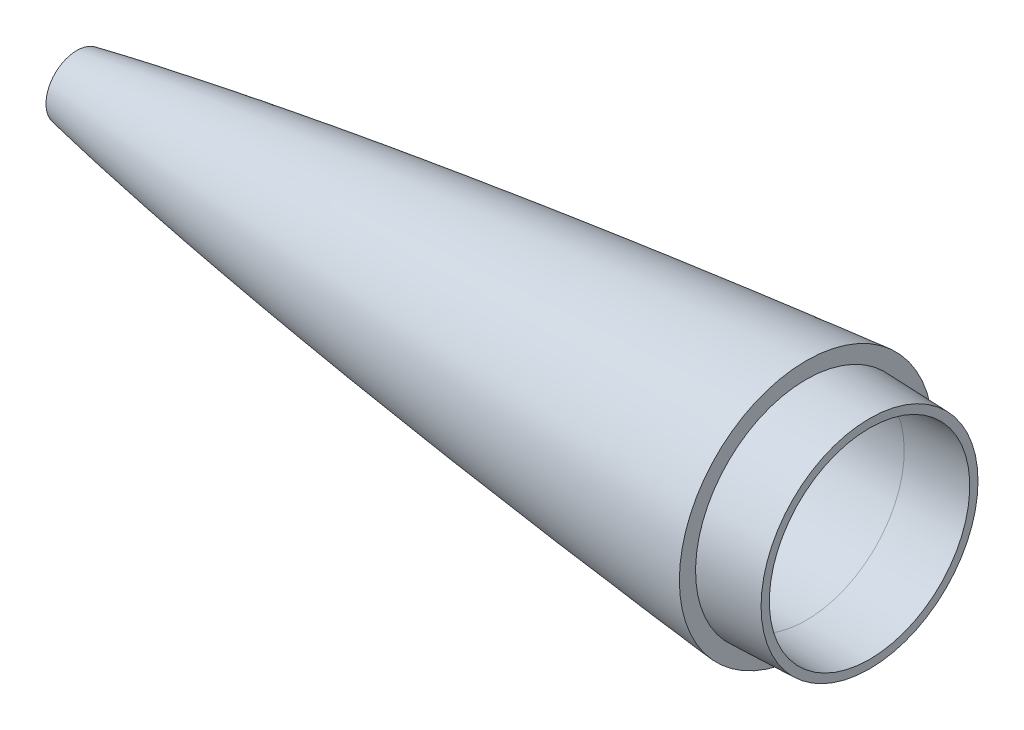
ISO-10303-21;
HEADER;
FILE_DESCRIPTION(('STEP AP214'),'2;1');
FILE_NAME('part.step','',(''),(''),'','','');
FILE_SCHEMA(('AUTOMOTIVE_DESIGN { 1 0 10303 214 1 1 1 1 }'));
ENDSEC;
DATA;
#1=APPLICATION_CONTEXT('core data for automotive mechanical design processes');
#2=APPLICATION_PROTOCOL_DEFINITION('international standard','automotive_design',2000,#1);
#3=PRODUCT_CONTEXT('',#1,'mechanical');
#4=PRODUCT('Part','Part','',(#3));
#5=PRODUCT_RELATED_PRODUCT_CATEGORY('part','',(#4));
#6=PRODUCT_DEFINITION_FORMATION('','',#4);
#7=PRODUCT_DEFINITION_CONTEXT('part definition',#1,'design');
#8=PRODUCT_DEFINITION('design','',#6,#7);
#9=PRODUCT_DEFINITION_SHAPE('','',#8);
#10=(LENGTH_UNIT() NAMED_UNIT(*) SI_UNIT(.MILLI.,.METRE.));
#11=(NAMED_UNIT(*) PLANE_ANGLE_UNIT() SI_UNIT($,.RADIAN.));
#12=(NAMED_UNIT(*) SI_UNIT($,.STERADIAN.) SOLID_ANGLE_UNIT());
#13=UNCERTAINTY_MEASURE_WITH_UNIT(LENGTH_MEASURE(1.E-05),#10,'distance_accuracy_value','');
#14=(GEOMETRIC_REPRESENTATION_CONTEXT(3) GLOBAL_UNCERTAINTY_ASSIGNED_CONTEXT((#13)) GLOBAL_UNIT_ASSIGNED_CONTEXT((#10,
#11,#12)) REPRESENTATION_CONTEXT('',''));
#15=CARTESIAN_POINT('',(0.,0.,0.));
#16=DIRECTION('',(0.,0.,1.));
#17=DIRECTION('',(1.,0.,0.));
#18=AXIS2_PLACEMENT_3D('',#15,#16,#17);
#19=CARTESIAN_POINT('',(-9.99999999999995,0.,0.));
#20=DIRECTION('',(1.,0.,0.));
#21=DIRECTION('',(0.,1.,0.));
#22=AXIS2_PLACEMENT_3D('',#19,#20,#21);
#23=DEGENERATE_TOROIDAL_SURFACE('',#22,2022.91313501116,2058.86901786388,.F.);
#24=CARTESIAN_POINT('',(-238.660865760801,0.,0.));
#25=DIRECTION('',(1.,0.,0.));
#26=DIRECTION('',(0.,1.,0.));
#27=AXIS2_PLACEMENT_3D('',#24,#25,#26);
#28=CIRCLE('',#27,23.2187867351589);
#29=CARTESIAN_POINT('',(-238.660865760801,23.2187867351589,0.));
#30=VERTEX_POINT('',#29);
#31=EDGE_CURVE('E64',#30,#30,#28,.F.);
#32=ORIENTED_EDGE('',*,*,#31,.F.);
#33=EDGE_LOOP('',(#32));
#34=FACE_BOUND('',#33,.T.);
#35=CARTESIAN_POINT('',(-372.8,0.,0.));
#36=DIRECTION('',(-1.,0.,0.));
#37=DIRECTION('',(0.,-1.,0.));
#38=AXIS2_PLACEMENT_3D('',#35,#36,#37);
#39=CIRCLE('',#38,3.73873265624036);
#40=CARTESIAN_POINT('',(-372.8,-3.73873265624037,0.));
#41=VERTEX_POINT('',#40);
#42=EDGE_CURVE('E51',#41,#41,#39,.T.);
#43=ORIENTED_EDGE('',*,*,#42,.T.);
#44=EDGE_LOOP('',(#43));
#45=FACE_BOUND('',#44,.T.);
#46=ADVANCED_FACE('F46',(#34,#45),#23,.T.);
#47=CARTESIAN_POINT('',(-210.,0.,0.));
#48=DIRECTION('',(1.,0.,0.));
#49=DIRECTION('',(0.,1.,0.));
#50=AXIS2_PLACEMENT_3D('',#47,#48,#49);
#51=PLANE('',#50);
#52=CARTESIAN_POINT('',(-210.,0.,0.));
#53=DIRECTION('',(1.,0.,0.));
#54=DIRECTION('',(0.,1.,0.));
#55=AXIS2_PLACEMENT_3D('',#52,#53,#54);
#56=CIRCLE('',#55,26.2187867351589);
#57=CARTESIAN_POINT('',(-210.,26.2187867351589,0.));
#58=VERTEX_POINT('',#57);
#59=EDGE_CURVE('E56',#58,#58,#56,.T.);
#60=ORIENTED_EDGE('',*,*,#59,.F.);
#61=EDGE_LOOP('',(#60));
#62=FACE_BOUND('',#61,.T.);
#63=CARTESIAN_POINT('',(-210.,0.,0.));
#64=DIRECTION('',(1.,0.,0.));
#65=DIRECTION('',(0.,1.,0.));
#66=AXIS2_PLACEMENT_3D('',#63,#64,#65);
#67=CIRCLE('',#66,30.0520321283327);
#68=CARTESIAN_POINT('',(-210.,30.0520321283327,0.));
#69=VERTEX_POINT('',#68);
#70=EDGE_CURVE('E11',#69,#69,#67,.T.);
#71=ORIENTED_EDGE('',*,*,#70,.T.);
#72=EDGE_LOOP('',(#71));
#73=FACE_BOUND('',#72,.T.);
#74=ADVANCED_FACE('F111',(#62,#73),#51,.T.);
#75=CARTESIAN_POINT('',(-410.,0.,0.));
#76=CARTESIAN_POINT('',(-409.996104343043,0.00976449689902335,0.));
#77=CARTESIAN_POINT('',(-409.985913153418,0.0279490747308062,0.));
#78=CARTESIAN_POINT('',(-409.957510571321,0.0594143028533337,0.));
#79=CARTESIAN_POINT('',(-409.898233487542,0.1142062146289,0.));
#80=CARTESIAN_POINT('',(-409.810537783304,0.17997009781727,0.));
#81=CARTESIAN_POINT('',(-409.676312366164,0.268169047261745,0.));
#82=CARTESIAN_POINT('',(-409.483787304396,0.379593537014922,0.));
#83=CARTESIAN_POINT('',(-409.212469031522,0.520885741333323,0.));
#84=CARTESIAN_POINT('',(-408.782228647582,0.722476645427516,0.));
#85=CARTESIAN_POINT('',(-408.0633328169,1.0244307263994,0.));
#86=CARTESIAN_POINT('',(-406.779619929941,1.50191951752579,0.));
#87=CARTESIAN_POINT('',(-404.418121727855,2.27068301003079,0.));
#88=CARTESIAN_POINT('',(-399.978466323839,3.52052425605253,0.));
#89=CARTESIAN_POINT('',(-392.218905514589,5.39313292092806,0.));
#90=CARTESIAN_POINT('',(-378.99508553227,8.1370308474546,0.));
#91=CARTESIAN_POINT('',(-360.816525388513,11.3764095789632,0.));
#92=CARTESIAN_POINT('',(-338.763877653047,14.8393803736611,0.));
#93=CARTESIAN_POINT('',(-314.22344301603,18.2908227784008,0.));
#94=CARTESIAN_POINT('',(-289.643356302951,21.4445876627348,0.));
#95=CARTESIAN_POINT('',(-265.032848706303,24.3508964604943,0.));
#96=CARTESIAN_POINT('',(-240.397990380166,27.0419167523867,0.));
#97=CARTESIAN_POINT('',(-215.742482431709,29.5365124328329,0.));
#98=CARTESIAN_POINT('',(-191.069036766365,31.8465331230353,0.));
#99=CARTESIAN_POINT('',(-166.37945951932,33.977380219421,0.));
#100=CARTESIAN_POINT('',(-141.675128405846,35.9296378563137,0.));
#101=CARTESIAN_POINT('',(-120.046737987028,37.4772955508728,0.));
#102=CARTESIAN_POINT('',(-101.499875990423,38.6821930104554,0.));
#103=CARTESIAN_POINT('',(-86.0387820796336,39.5986846871677,0.));
#104=CARTESIAN_POINT('',(-73.6667078642432,40.2757568211507,0.));
#105=CARTESIAN_POINT('',(-61.2914278422817,40.891966910061,0.));
#106=CARTESIAN_POINT('',(-50.4602491167538,41.3719286432088,0.));
#107=CARTESIAN_POINT('',(-41.1743618881754,41.734883373498,0.));
#108=CARTESIAN_POINT('',(-33.7119783029498,41.990289016737,0.));
#109=CARTESIAN_POINT('',(-28.0740328307755,42.1616169192843,0.));
#110=CARTESIAN_POINT('',(-23.348213609555,42.2851869219609,0.));
#111=CARTESIAN_POINT('',(-19.5348329703601,42.3707970808382,0.));
#112=CARTESIAN_POINT('',(-16.3567770901304,42.4293425512698,0.));
#113=CARTESIAN_POINT('',(-13.8141878860374,42.4697024103388,0.));
#114=CARTESIAN_POINT('',(-11.9071370262904,42.4885808321882,0.));
#115=CARTESIAN_POINT('',(-10.6357205008744,42.5,0.));
#116=CARTESIAN_POINT('',(-10.,42.5,0.));
#117=B_SPLINE_CURVE_WITH_KNOTS('',4,(#75,#76,#77,#78,#79,#80,#81,#82,#83,#84,#85,#86,#87,#88,
#89,#90,#91,#92,#93,#94,#95,#96,#97,#98,#99,#100,#101,#102,#103,#104,#105,#106,#107,#108,#109,
#110,#111,#112,#113,#114,#115,#116),.UNSPECIFIED.,.F.,.F.,(5,1,1,1,1,1,1,1,1,1,1,1,1,1,1,1,1,1,
1,1,1,1,1,1,1,1,1,1,1,1,1,1,1,1,1,1,1,1,5),(0.,0.000103976649997164,0.000207953299994328,
0.000415906599988656,0.000802400832158779,0.0011888950643289,0.00180194634259952,
0.00262226433761093,0.00383760912219115,0.00590297682370642,0.00953833140140297,
0.0162115071217174,0.0284781652553806,0.0516657978335034,0.0887424461283376,0.150226816133671,
0.21171149926333,0.273196105735341,0.334680800715612,0.39616535123727,0.457649954473699,
0.519134577796471,0.580619208254549,0.642103779420138,0.703588442284778,0.765073031966271,
0.795815244440737,0.826557456915203,0.857299729388856,0.888042001862508,0.918784365418666,
0.934155547196744,0.949526728974823,0.962145046731117,0.974763364487412,0.981072523365559,
0.987381682243706,0.993690841121853,1.),.UNSPECIFIED.);
#118=CARTESIAN_POINT('',(-393.098004326676,0.,0.));
#119=DIRECTION('',(1.,0.,0.));
#120=AXIS1_PLACEMENT('',#118,#119);
#121=SURFACE_OF_REVOLUTION('',#117,#120);
#122=CARTESIAN_POINT('',(-382.8,0.,0.));
#123=DIRECTION('',(1.,0.,0.));
#124=DIRECTION('',(0.,1.,0.));
#125=AXIS2_PLACEMENT_3D('',#122,#123,#124);
#126=CIRCLE('',#125,7.29726862571316);
#127=CARTESIAN_POINT('',(-382.8,7.29726862571316,0.));
#128=VERTEX_POINT('',#127);
#129=EDGE_CURVE('E75',#128,#128,#126,.T.);
#130=ORIENTED_EDGE('',*,*,#129,.T.);
#131=EDGE_LOOP('',(#130));
#132=FACE_BOUND('',#131,.T.);
#133=ORIENTED_EDGE('',*,*,#70,.F.);
#134=EDGE_LOOP('',(#133));
#135=FACE_BOUND('',#134,.T.);
#136=ADVANCED_FACE('F48',(#132,#135),#121,.T.);
#137=CARTESIAN_POINT('',(-195.,0.,0.));
#138=DIRECTION('',(1.,0.,0.));
#139=DIRECTION('',(0.,1.,0.));
#140=AXIS2_PLACEMENT_3D('',#137,#138,#139);
#141=PLANE('',#140);
#142=CARTESIAN_POINT('',(-195.,0.,0.));
#143=DIRECTION('',(1.,0.,0.));
#144=DIRECTION('',(0.,1.,0.));
#145=AXIS2_PLACEMENT_3D('',#142,#143,#144);
#146=CIRCLE('',#145,25.6949751927827);
#147=CARTESIAN_POINT('',(-195.,25.6949751927827,0.));
#148=VERTEX_POINT('',#147);
#149=EDGE_CURVE('E62',#148,#148,#146,.T.);
#150=ORIENTED_EDGE('',*,*,#149,.T.);
#151=EDGE_LOOP('',(#150));
#152=FACE_BOUND('',#151,.T.);
#153=CARTESIAN_POINT('',(-195.,0.,0.));
#154=DIRECTION('',(1.,0.,0.));
#155=DIRECTION('',(0.,1.,0.));
#156=AXIS2_PLACEMENT_3D('',#153,#154,#155);
#157=CIRCLE('',#156,23.7425982775351);
#158=CARTESIAN_POINT('',(-195.,23.7425982775351,0.));
#159=VERTEX_POINT('',#158);
#160=EDGE_CURVE('E76',#159,#159,#157,.T.);
#161=ORIENTED_EDGE('',*,*,#160,.F.);
#162=EDGE_LOOP('',(#161));
#163=FACE_BOUND('',#162,.T.);
#164=ADVANCED_FACE('F110',(#152,#163),#141,.T.);
#165=CARTESIAN_POINT('',(-210.,0.,0.));
#166=DIRECTION('',(-1.,0.,0.));
#167=DIRECTION('',(0.,1.,0.));
#168=AXIS2_PLACEMENT_3D('',#165,#166,#167);
#169=CONICAL_SURFACE('',#168,26.2187867351589,0.0349065850398867);
#170=ORIENTED_EDGE('',*,*,#149,.F.);
#171=EDGE_LOOP('',(#170));
#172=FACE_BOUND('',#171,.T.);
#173=ORIENTED_EDGE('',*,*,#59,.T.);
#174=EDGE_LOOP('',(#173));
#175=FACE_BOUND('',#174,.T.);
#176=ADVANCED_FACE('F117',(#172,#175),#169,.T.);
#177=CARTESIAN_POINT('',(-210.,0.,0.));
#178=DIRECTION('',(1.,0.,0.));
#179=DIRECTION('',(0.,1.,0.));
#180=AXIS2_PLACEMENT_3D('',#177,#178,#179);
#181=CONICAL_SURFACE('',#180,23.2187867351589,0.0349065850398867);
#182=ORIENTED_EDGE('',*,*,#160,.T.);
#183=EDGE_LOOP('',(#182));
#184=FACE_BOUND('',#183,.T.);
#185=CARTESIAN_POINT('',(-210.,0.,0.));
#186=DIRECTION('',(1.,0.,0.));
#187=DIRECTION('',(0.,1.,0.));
#188=AXIS2_PLACEMENT_3D('',#185,#186,#187);
#189=CIRCLE('',#188,23.2187867351589);
#190=CARTESIAN_POINT('',(-210.,23.2187867351589,0.));
#191=VERTEX_POINT('',#190);
#192=EDGE_CURVE('E74',#191,#191,#189,.T.);
#193=ORIENTED_EDGE('',*,*,#192,.F.);
#194=EDGE_LOOP('',(#193));
#195=FACE_BOUND('',#194,.T.);
#196=ADVANCED_FACE('F105',(#184,#195),#181,.F.);
#197=CARTESIAN_POINT('',(-423.248328377335,0.,0.));
#198=DIRECTION('',(1.,0.,0.));
#199=DIRECTION('',(0.,1.,0.));
#200=AXIS2_PLACEMENT_3D('',#197,#198,#199);
#201=CYLINDRICAL_SURFACE('',#200,23.2187867351589);
#202=ORIENTED_EDGE('',*,*,#31,.T.);
#203=EDGE_LOOP('',(#202));
#204=FACE_BOUND('',#203,.T.);
#205=ORIENTED_EDGE('',*,*,#192,.T.);
#206=EDGE_LOOP('',(#205));
#207=FACE_BOUND('',#206,.T.);
#208=ADVANCED_FACE('F103',(#204,#207),#201,.F.);
#209=CARTESIAN_POINT('',(-382.8,0.,0.));
#210=DIRECTION('',(1.,0.,0.));
#211=DIRECTION('',(0.,1.,0.));
#212=AXIS2_PLACEMENT_3D('',#209,#210,#211);
#213=PLANE('',#212);
#214=CARTESIAN_POINT('',(-382.8,0.,0.));
#215=DIRECTION('',(-1.,0.,0.));
#216=DIRECTION('',(0.,-1.,0.));
#217=AXIS2_PLACEMENT_3D('',#214,#215,#216);
#218=CIRCLE('',#217,7.1);
#219=CARTESIAN_POINT('',(-382.8,-7.10000000000001,0.));
#220=VERTEX_POINT('',#219);
#221=EDGE_CURVE('E93',#220,#220,#218,.T.);
#222=ORIENTED_EDGE('',*,*,#221,.F.);
#223=EDGE_LOOP('',(#222));
#224=FACE_BOUND('',#223,.T.);
#225=ORIENTED_EDGE('',*,*,#129,.F.);
#226=EDGE_LOOP('',(#225));
#227=FACE_BOUND('',#226,.T.);
#228=ADVANCED_FACE('F100',(#224,#227),#213,.F.);
#229=CARTESIAN_POINT('',(-382.8,0.,0.));
#230=DIRECTION('',(-1.,0.,0.));
#231=DIRECTION('',(0.,-1.,0.));
#232=AXIS2_PLACEMENT_3D('',#229,#230,#231);
#233=CONICAL_SURFACE('',#232,7.1,0.0698131700797733);
#234=CARTESIAN_POINT('',(-372.8,0.,0.));
#235=DIRECTION('',(-1.,0.,0.));
#236=DIRECTION('',(0.,-1.,0.));
#237=AXIS2_PLACEMENT_3D('',#234,#235,#236);
#238=CIRCLE('',#237,6.40073188056489);
#239=CARTESIAN_POINT('',(-372.8,-6.4007318805649,0.));
#240=VERTEX_POINT('',#239);
#241=EDGE_CURVE('E89',#240,#240,#238,.T.);
#242=ORIENTED_EDGE('',*,*,#241,.F.);
#243=EDGE_LOOP('',(#242));
#244=FACE_BOUND('',#243,.T.);
#245=ORIENTED_EDGE('',*,*,#221,.T.);
#246=EDGE_LOOP('',(#245));
#247=FACE_BOUND('',#246,.T.);
#248=ADVANCED_FACE('F98',(#244,#247),#233,.F.);
#249=CARTESIAN_POINT('',(-372.8,0.,0.));
#250=DIRECTION('',(-1.,0.,0.));
#251=DIRECTION('',(0.,-1.,0.));
#252=AXIS2_PLACEMENT_3D('',#249,#250,#251);
#253=PLANE('',#252);
#254=ORIENTED_EDGE('',*,*,#42,.F.);
#255=EDGE_LOOP('',(#254));
#256=FACE_BOUND('',#255,.T.);
#257=ORIENTED_EDGE('',*,*,#241,.T.);
#258=EDGE_LOOP('',(#257));
#259=FACE_BOUND('',#258,.T.);
#260=ADVANCED_FACE('F141',(#256,#259),#253,.T.);
#261=CLOSED_SHELL('',(#46,#74,#136,#164,#176,#196,#208,#228,#248,#260));
#262=MANIFOLD_SOLID_BREP('B2',#261);
#263=ADVANCED_BREP_SHAPE_REPRESENTATION('',(#18,#262),#14);
#264=SHAPE_DEFINITION_REPRESENTATION(#9,#263);
ENDSEC;
END-ISO-10303-21;
